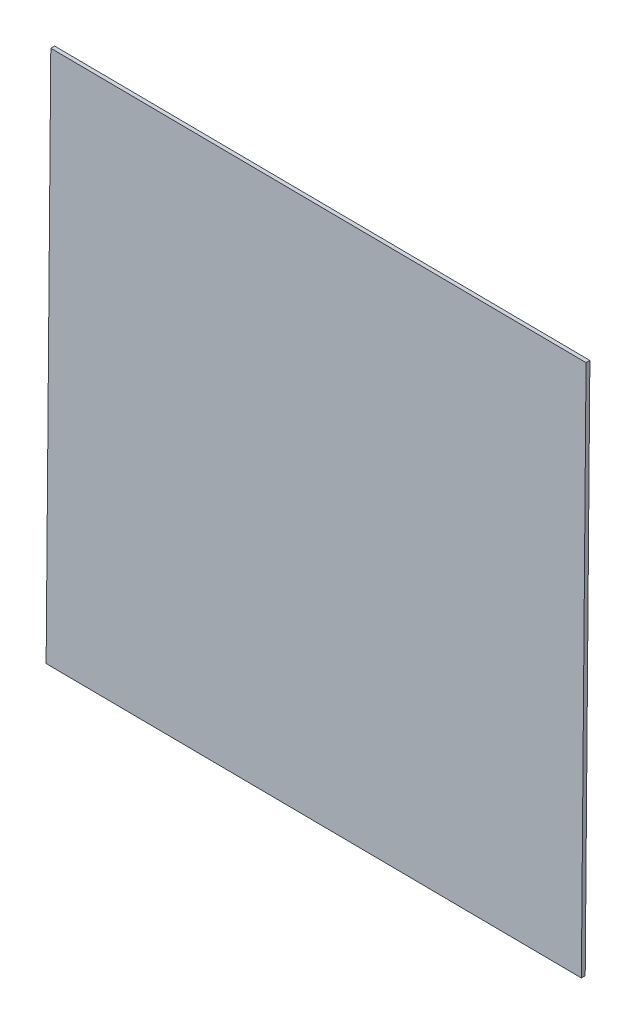
ISO-10303-21;
HEADER;
FILE_DESCRIPTION(('STEP AP214'),'2;1');
FILE_NAME('part.step','',(''),(''),'','','');
FILE_SCHEMA(('AUTOMOTIVE_DESIGN { 1 0 10303 214 1 1 1 1 }'));
ENDSEC;
DATA;
#1=APPLICATION_CONTEXT('core data for automotive mechanical design processes');
#2=APPLICATION_PROTOCOL_DEFINITION('international standard','automotive_design',2000,#1);
#3=PRODUCT_CONTEXT('',#1,'mechanical');
#4=PRODUCT('Part','Part','',(#3));
#5=PRODUCT_RELATED_PRODUCT_CATEGORY('part','',(#4));
#6=PRODUCT_DEFINITION_FORMATION('','',#4);
#7=PRODUCT_DEFINITION_CONTEXT('part definition',#1,'design');
#8=PRODUCT_DEFINITION('design','',#6,#7);
#9=PRODUCT_DEFINITION_SHAPE('','',#8);
#10=(LENGTH_UNIT() NAMED_UNIT(*) SI_UNIT(.MILLI.,.METRE.));
#11=(NAMED_UNIT(*) PLANE_ANGLE_UNIT() SI_UNIT($,.RADIAN.));
#12=(NAMED_UNIT(*) SI_UNIT($,.STERADIAN.) SOLID_ANGLE_UNIT());
#13=UNCERTAINTY_MEASURE_WITH_UNIT(LENGTH_MEASURE(1.E-05),#10,'distance_accuracy_value','');
#14=(GEOMETRIC_REPRESENTATION_CONTEXT(3) GLOBAL_UNCERTAINTY_ASSIGNED_CONTEXT((#13)) GLOBAL_UNIT_ASSIGNED_CONTEXT((#10,
#11,#12)) REPRESENTATION_CONTEXT('',''));
#15=CARTESIAN_POINT('',(0.,0.,0.));
#16=DIRECTION('',(0.,0.,1.));
#17=DIRECTION('',(1.,0.,0.));
#18=AXIS2_PLACEMENT_3D('',#15,#16,#17);
#19=CARTESIAN_POINT('',(-79.8313802902276,73.8109052166158,0.126999999999988));
#20=DIRECTION('',(-0.00872653549836423,-0.999961923064171,0.));
#21=DIRECTION('',(0.999961923064172,-0.00872653549836417,0.));
#22=AXIS2_PLACEMENT_3D('',#19,#20,#21);
#23=PLANE('',#22);
#24=DIRECTION('',(-0.999961923064171,0.00872653549836417,0.));
#25=VECTOR('',#24,1.);
#26=CARTESIAN_POINT('',(-79.8313802902276,73.8109052166158,0.));
#27=LINE('',#26,#25);
#28=CARTESIAN_POINT('',(-79.8313802902276,73.8109052166158,0.));
#29=VERTEX_POINT('',#28);
#30=CARTESIAN_POINT('',(-97.5599052166167,73.9656197097642,1.24344978758018E-11));
#31=VERTEX_POINT('',#30);
#32=EDGE_CURVE('E97',#29,#31,#27,.T.);
#33=ORIENTED_EDGE('',*,*,#32,.T.);
#34=DIRECTION('',(0.,0.,-1.00000000000001));
#35=VECTOR('',#34,1.);
#36=CARTESIAN_POINT('',(-97.5599052166167,73.9656197097678,0.127000000015087));
#37=LINE('',#36,#35);
#38=CARTESIAN_POINT('',(-97.5599052166167,73.9656197097678,0.127000000015087));
#39=VERTEX_POINT('',#38);
#40=EDGE_CURVE('E11',#39,#31,#37,.T.);
#41=ORIENTED_EDGE('',*,*,#40,.F.);
#42=DIRECTION('',(-0.999961923064171,0.00872653549836417,0.));
#43=VECTOR('',#42,1.);
#44=CARTESIAN_POINT('',(-79.8313802902276,73.8109052166158,0.126999999999988));
#45=LINE('',#44,#43);
#46=CARTESIAN_POINT('',(-79.8313802902276,73.8109052166158,0.126999999999988));
#47=VERTEX_POINT('',#46);
#48=EDGE_CURVE('E85',#47,#39,#45,.T.);
#49=ORIENTED_EDGE('',*,*,#48,.F.);
#50=DIRECTION('',(0.,0.,-1.00000000000001));
#51=VECTOR('',#50,1.);
#52=CARTESIAN_POINT('',(-79.8313802902276,73.8109052166158,0.126999999999988));
#53=LINE('',#52,#51);
#54=EDGE_CURVE('E93',#47,#29,#53,.T.);
#55=ORIENTED_EDGE('',*,*,#54,.T.);
#56=EDGE_LOOP('',(#33,#41,#49,#55));
#57=FACE_BOUND('',#56,.T.);
#58=ADVANCED_FACE('F34',(#57),#23,.F.);
#59=CARTESIAN_POINT('',(-97.5599052166167,73.9656197097678,0.127000000015087));
#60=DIRECTION('',(0.999961923064171,-0.00872653549836573,0.));
#61=DIRECTION('',(0.00872653549836581,0.999961923064171,0.));
#62=AXIS2_PLACEMENT_3D('',#59,#60,#61);
#63=PLANE('',#62);
#64=DIRECTION('',(-0.00872653549836581,-0.999961923064171,0.));
#65=VECTOR('',#64,1.);
#66=CARTESIAN_POINT('',(-97.5599052166167,73.9656197097642,1.24344978758018E-11));
#67=LINE('',#66,#65);
#68=CARTESIAN_POINT('',(-97.7146197097743,56.237094783381,3.5527136788005E-12));
#69=VERTEX_POINT('',#68);
#70=EDGE_CURVE('E89',#31,#69,#67,.T.);
#71=ORIENTED_EDGE('',*,*,#70,.T.);
#72=DIRECTION('',(0.,0.,-1.00000000000001));
#73=VECTOR('',#72,1.);
#74=CARTESIAN_POINT('',(-97.7146197097747,56.2370947833828,0.127000000005317));
#75=LINE('',#74,#73);
#76=CARTESIAN_POINT('',(-97.7146197097747,56.2370947833828,0.127000000005317));
#77=VERTEX_POINT('',#76);
#78=EDGE_CURVE('E42',#77,#69,#75,.T.);
#79=ORIENTED_EDGE('',*,*,#78,.F.);
#80=DIRECTION('',(-0.00872653549836581,-0.999961923064171,0.));
#81=VECTOR('',#80,1.);
#82=CARTESIAN_POINT('',(-97.5599052166167,73.9656197097678,0.127000000015087));
#83=LINE('',#82,#81);
#84=EDGE_CURVE('E80',#39,#77,#83,.T.);
#85=ORIENTED_EDGE('',*,*,#84,.F.);
#86=ORIENTED_EDGE('',*,*,#40,.T.);
#87=EDGE_LOOP('',(#71,#79,#85,#86));
#88=FACE_BOUND('',#87,.T.);
#89=ADVANCED_FACE('F88',(#88),#63,.F.);
#90=CARTESIAN_POINT('',(-97.7146197097747,56.2370947833828,0.127000000005317));
#91=DIRECTION('',(0.00872653549837131,0.999961923064172,0.));
#92=DIRECTION('',(-0.999961923064176,0.00872653549837128,0.));
#93=AXIS2_PLACEMENT_3D('',#90,#91,#92);
#94=PLANE('',#93);
#95=DIRECTION('',(0.999961923064175,-0.00872653549837128,0.));
#96=VECTOR('',#95,1.);
#97=CARTESIAN_POINT('',(-97.7146197097743,56.237094783381,3.5527136788005E-12));
#98=LINE('',#97,#96);
#99=CARTESIAN_POINT('',(-79.9860947833856,56.0823802902237,5.32907051820075E-12));
#100=VERTEX_POINT('',#99);
#101=EDGE_CURVE('E67',#69,#100,#98,.T.);
#102=ORIENTED_EDGE('',*,*,#101,.T.);
#103=DIRECTION('',(0.,0.,-1.00000000000001));
#104=VECTOR('',#103,1.);
#105=CARTESIAN_POINT('',(-79.9860947833858,56.0823802902264,0.127000000004429));
#106=LINE('',#105,#104);
#107=CARTESIAN_POINT('',(-79.9860947833858,56.0823802902264,0.127000000004429));
#108=VERTEX_POINT('',#107);
#109=EDGE_CURVE('E90',#108,#100,#106,.T.);
#110=ORIENTED_EDGE('',*,*,#109,.F.);
#111=DIRECTION('',(0.999961923064175,-0.00872653549837128,0.));
#112=VECTOR('',#111,1.);
#113=CARTESIAN_POINT('',(-97.7146197097747,56.2370947833828,0.127000000005317));
#114=LINE('',#113,#112);
#115=EDGE_CURVE('E83',#77,#108,#114,.T.);
#116=ORIENTED_EDGE('',*,*,#115,.F.);
#117=ORIENTED_EDGE('',*,*,#78,.T.);
#118=EDGE_LOOP('',(#102,#110,#116,#117));
#119=FACE_BOUND('',#118,.T.);
#120=ADVANCED_FACE('F91',(#119),#94,.F.);
#121=CARTESIAN_POINT('',(-79.9860947833858,56.0823802902264,0.127000000004429));
#122=DIRECTION('',(-0.999961923064176,0.00872653549836727,0.));
#123=DIRECTION('',(-0.00872653549836735,-0.999961923064176,0.));
#124=AXIS2_PLACEMENT_3D('',#121,#122,#123);
#125=PLANE('',#124);
#126=DIRECTION('',(0.00872653549836735,0.999961923064176,0.));
#127=VECTOR('',#126,1.);
#128=CARTESIAN_POINT('',(-79.9860947833856,56.0823802902237,5.32907051820075E-12));
#129=LINE('',#128,#127);
#130=EDGE_CURVE('E73',#100,#29,#129,.T.);
#131=ORIENTED_EDGE('',*,*,#130,.T.);
#132=ORIENTED_EDGE('',*,*,#54,.F.);
#133=DIRECTION('',(0.00872653549836735,0.999961923064176,0.));
#134=VECTOR('',#133,1.);
#135=CARTESIAN_POINT('',(-79.9860947833858,56.0823802902264,0.127000000004429));
#136=LINE('',#135,#134);
#137=EDGE_CURVE('E50',#108,#47,#136,.T.);
#138=ORIENTED_EDGE('',*,*,#137,.F.);
#139=ORIENTED_EDGE('',*,*,#109,.T.);
#140=EDGE_LOOP('',(#131,#132,#138,#139));
#141=FACE_BOUND('',#140,.T.);
#142=ADVANCED_FACE('F104',(#141),#125,.F.);
#143=CARTESIAN_POINT('',(0.,-4.44089209850063E-13,0.127000000015975));
#144=DIRECTION('',(0.,0.,1.00000000000001));
#145=DIRECTION('',(1.,0.,0.));
#146=AXIS2_PLACEMENT_3D('',#143,#144,#145);
#147=PLANE('',#146);
#148=ORIENTED_EDGE('',*,*,#48,.T.);
#149=ORIENTED_EDGE('',*,*,#84,.T.);
#150=ORIENTED_EDGE('',*,*,#115,.T.);
#151=ORIENTED_EDGE('',*,*,#137,.T.);
#152=EDGE_LOOP('',(#148,#149,#150,#151));
#153=FACE_BOUND('',#152,.T.);
#154=ADVANCED_FACE('F81',(#153),#147,.T.);
#155=CARTESIAN_POINT('',(0.,0.,0.));
#156=DIRECTION('',(0.,0.,1.00000000000001));
#157=DIRECTION('',(1.,0.,0.));
#158=AXIS2_PLACEMENT_3D('',#155,#156,#157);
#159=PLANE('',#158);
#160=ORIENTED_EDGE('',*,*,#32,.F.);
#161=ORIENTED_EDGE('',*,*,#130,.F.);
#162=ORIENTED_EDGE('',*,*,#101,.F.);
#163=ORIENTED_EDGE('',*,*,#70,.F.);
#164=EDGE_LOOP('',(#160,#161,#162,#163));
#165=FACE_BOUND('',#164,.T.);
#166=ADVANCED_FACE('F107',(#165),#159,.F.);
#167=CLOSED_SHELL('',(#58,#89,#120,#142,#154,#166));
#168=MANIFOLD_SOLID_BREP('B2',#167);
#169=ADVANCED_BREP_SHAPE_REPRESENTATION('',(#18,#168),#14);
#170=SHAPE_DEFINITION_REPRESENTATION(#9,#169);
ENDSEC;
END-ISO-10303-21;
